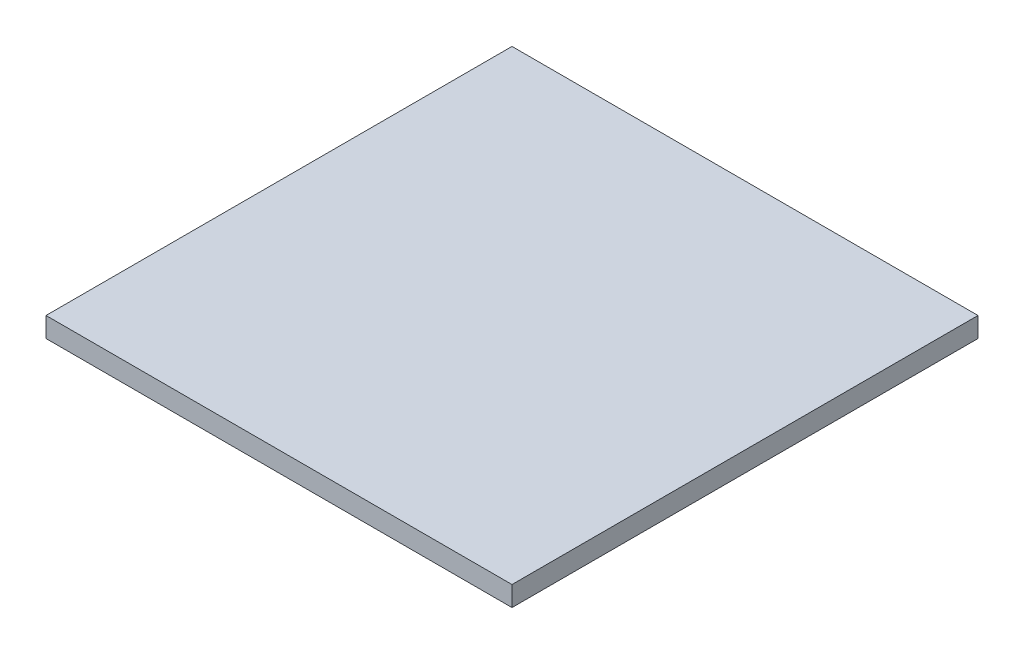
ISO-10303-21;
HEADER;
FILE_DESCRIPTION(('STEP AP214'),'2;1');
FILE_NAME('part.step','',(''),(''),'','','');
FILE_SCHEMA(('AUTOMOTIVE_DESIGN { 1 0 10303 214 1 1 1 1 }'));
ENDSEC;
DATA;
#1=APPLICATION_CONTEXT('core data for automotive mechanical design processes');
#2=APPLICATION_PROTOCOL_DEFINITION('international standard','automotive_design',2000,#1);
#3=PRODUCT_CONTEXT('',#1,'mechanical');
#4=PRODUCT('Part','Part','',(#3));
#5=PRODUCT_RELATED_PRODUCT_CATEGORY('part','',(#4));
#6=PRODUCT_DEFINITION_FORMATION('','',#4);
#7=PRODUCT_DEFINITION_CONTEXT('part definition',#1,'design');
#8=PRODUCT_DEFINITION('design','',#6,#7);
#9=PRODUCT_DEFINITION_SHAPE('','',#8);
#10=(LENGTH_UNIT() NAMED_UNIT(*) SI_UNIT(.MILLI.,.METRE.));
#11=(NAMED_UNIT(*) PLANE_ANGLE_UNIT() SI_UNIT($,.RADIAN.));
#12=(NAMED_UNIT(*) SI_UNIT($,.STERADIAN.) SOLID_ANGLE_UNIT());
#13=UNCERTAINTY_MEASURE_WITH_UNIT(LENGTH_MEASURE(1.E-05),#10,'distance_accuracy_value','');
#14=(GEOMETRIC_REPRESENTATION_CONTEXT(3) GLOBAL_UNCERTAINTY_ASSIGNED_CONTEXT((#13)) GLOBAL_UNIT_ASSIGNED_CONTEXT((#10,
#11,#12)) REPRESENTATION_CONTEXT('',''));
#15=CARTESIAN_POINT('',(0.,0.,0.));
#16=DIRECTION('',(0.,0.,1.));
#17=DIRECTION('',(1.,0.,0.));
#18=AXIS2_PLACEMENT_3D('',#15,#16,#17);
#19=CARTESIAN_POINT('',(-458.461538461538,15.,-38.8461538461538));
#20=DIRECTION('',(1.,0.,0.));
#21=DIRECTION('',(0.,0.,-1.));
#22=AXIS2_PLACEMENT_3D('',#19,#20,#21);
#23=PLANE('',#22);
#24=DIRECTION('',(0.,0.,1.));
#25=VECTOR('',#24,1.);
#26=CARTESIAN_POINT('',(-458.461538461538,0.,-38.8461538461538));
#27=LINE('',#26,#25);
#28=CARTESIAN_POINT('',(-458.461538461538,0.,-388.846153846154));
#29=VERTEX_POINT('',#28);
#30=CARTESIAN_POINT('',(-458.461538461538,0.,-38.8461538461538));
#31=VERTEX_POINT('',#30);
#32=EDGE_CURVE('E95',#29,#31,#27,.T.);
#33=ORIENTED_EDGE('',*,*,#32,.T.);
#34=DIRECTION('',(0.,-1.,0.));
#35=VECTOR('',#34,1.);
#36=CARTESIAN_POINT('',(-458.461538461538,15.,-38.8461538461538));
#37=LINE('',#36,#35);
#38=CARTESIAN_POINT('',(-458.461538461538,15.,-38.8461538461538));
#39=VERTEX_POINT('',#38);
#40=EDGE_CURVE('E11',#39,#31,#37,.T.);
#41=ORIENTED_EDGE('',*,*,#40,.F.);
#42=DIRECTION('',(0.,0.,1.));
#43=VECTOR('',#42,1.);
#44=CARTESIAN_POINT('',(-458.461538461538,15.,-38.8461538461538));
#45=LINE('',#44,#43);
#46=CARTESIAN_POINT('',(-458.461538461538,15.,-388.846153846154));
#47=VERTEX_POINT('',#46);
#48=EDGE_CURVE('E83',#47,#39,#45,.T.);
#49=ORIENTED_EDGE('',*,*,#48,.F.);
#50=DIRECTION('',(0.,-1.,0.));
#51=VECTOR('',#50,1.);
#52=CARTESIAN_POINT('',(-458.461538461538,15.,-388.846153846154));
#53=LINE('',#52,#51);
#54=EDGE_CURVE('E91',#47,#29,#53,.T.);
#55=ORIENTED_EDGE('',*,*,#54,.T.);
#56=EDGE_LOOP('',(#33,#41,#49,#55));
#57=FACE_BOUND('',#56,.T.);
#58=ADVANCED_FACE('F32',(#57),#23,.F.);
#59=CARTESIAN_POINT('',(-458.461538461538,15.,-38.8461538461538));
#60=DIRECTION('',(0.,0.,-1.));
#61=DIRECTION('',(-1.,0.,0.));
#62=AXIS2_PLACEMENT_3D('',#59,#60,#61);
#63=PLANE('',#62);
#64=DIRECTION('',(1.,0.,0.));
#65=VECTOR('',#64,1.);
#66=CARTESIAN_POINT('',(-458.461538461538,0.,-38.8461538461538));
#67=LINE('',#66,#65);
#68=CARTESIAN_POINT('',(-108.461538461538,0.,-38.8461538461538));
#69=VERTEX_POINT('',#68);
#70=EDGE_CURVE('E87',#31,#69,#67,.T.);
#71=ORIENTED_EDGE('',*,*,#70,.T.);
#72=DIRECTION('',(0.,-1.,0.));
#73=VECTOR('',#72,1.);
#74=CARTESIAN_POINT('',(-108.461538461538,15.,-38.8461538461538));
#75=LINE('',#74,#73);
#76=CARTESIAN_POINT('',(-108.461538461538,15.,-38.8461538461538));
#77=VERTEX_POINT('',#76);
#78=EDGE_CURVE('E40',#77,#69,#75,.T.);
#79=ORIENTED_EDGE('',*,*,#78,.F.);
#80=DIRECTION('',(1.,0.,0.));
#81=VECTOR('',#80,1.);
#82=CARTESIAN_POINT('',(-458.461538461538,15.,-38.8461538461538));
#83=LINE('',#82,#81);
#84=EDGE_CURVE('E78',#39,#77,#83,.T.);
#85=ORIENTED_EDGE('',*,*,#84,.F.);
#86=ORIENTED_EDGE('',*,*,#40,.T.);
#87=EDGE_LOOP('',(#71,#79,#85,#86));
#88=FACE_BOUND('',#87,.T.);
#89=ADVANCED_FACE('F86',(#88),#63,.F.);
#90=CARTESIAN_POINT('',(-108.461538461538,15.,-38.8461538461538));
#91=DIRECTION('',(-1.,0.,0.));
#92=DIRECTION('',(0.,0.,1.));
#93=AXIS2_PLACEMENT_3D('',#90,#91,#92);
#94=PLANE('',#93);
#95=DIRECTION('',(0.,0.,-1.));
#96=VECTOR('',#95,1.);
#97=CARTESIAN_POINT('',(-108.461538461538,0.,-38.8461538461538));
#98=LINE('',#97,#96);
#99=CARTESIAN_POINT('',(-108.461538461538,0.,-388.846153846154));
#100=VERTEX_POINT('',#99);
#101=EDGE_CURVE('E65',#69,#100,#98,.T.);
#102=ORIENTED_EDGE('',*,*,#101,.T.);
#103=DIRECTION('',(0.,-1.,0.));
#104=VECTOR('',#103,1.);
#105=CARTESIAN_POINT('',(-108.461538461538,15.,-388.846153846154));
#106=LINE('',#105,#104);
#107=CARTESIAN_POINT('',(-108.461538461538,15.,-388.846153846154));
#108=VERTEX_POINT('',#107);
#109=EDGE_CURVE('E88',#108,#100,#106,.T.);
#110=ORIENTED_EDGE('',*,*,#109,.F.);
#111=DIRECTION('',(0.,0.,-1.));
#112=VECTOR('',#111,1.);
#113=CARTESIAN_POINT('',(-108.461538461538,15.,-38.8461538461538));
#114=LINE('',#113,#112);
#115=EDGE_CURVE('E81',#77,#108,#114,.T.);
#116=ORIENTED_EDGE('',*,*,#115,.F.);
#117=ORIENTED_EDGE('',*,*,#78,.T.);
#118=EDGE_LOOP('',(#102,#110,#116,#117));
#119=FACE_BOUND('',#118,.T.);
#120=ADVANCED_FACE('F89',(#119),#94,.F.);
#121=CARTESIAN_POINT('',(-458.461538461538,15.,-388.846153846154));
#122=DIRECTION('',(0.,0.,1.));
#123=DIRECTION('',(1.,0.,0.));
#124=AXIS2_PLACEMENT_3D('',#121,#122,#123);
#125=PLANE('',#124);
#126=DIRECTION('',(-1.,0.,0.));
#127=VECTOR('',#126,1.);
#128=CARTESIAN_POINT('',(-458.461538461538,0.,-388.846153846154));
#129=LINE('',#128,#127);
#130=EDGE_CURVE('E71',#100,#29,#129,.T.);
#131=ORIENTED_EDGE('',*,*,#130,.T.);
#132=ORIENTED_EDGE('',*,*,#54,.F.);
#133=DIRECTION('',(-1.,0.,0.));
#134=VECTOR('',#133,1.);
#135=CARTESIAN_POINT('',(-458.461538461538,15.,-388.846153846154));
#136=LINE('',#135,#134);
#137=EDGE_CURVE('E48',#108,#47,#136,.T.);
#138=ORIENTED_EDGE('',*,*,#137,.F.);
#139=ORIENTED_EDGE('',*,*,#109,.T.);
#140=EDGE_LOOP('',(#131,#132,#138,#139));
#141=FACE_BOUND('',#140,.T.);
#142=ADVANCED_FACE('F102',(#141),#125,.F.);
#143=CARTESIAN_POINT('',(0.,15.,0.));
#144=DIRECTION('',(0.,-1.,0.));
#145=DIRECTION('',(0.,0.,-1.));
#146=AXIS2_PLACEMENT_3D('',#143,#144,#145);
#147=PLANE('',#146);
#148=ORIENTED_EDGE('',*,*,#48,.T.);
#149=ORIENTED_EDGE('',*,*,#84,.T.);
#150=ORIENTED_EDGE('',*,*,#115,.T.);
#151=ORIENTED_EDGE('',*,*,#137,.T.);
#152=EDGE_LOOP('',(#148,#149,#150,#151));
#153=FACE_BOUND('',#152,.T.);
#154=ADVANCED_FACE('F79',(#153),#147,.F.);
#155=CARTESIAN_POINT('',(0.,0.,0.));
#156=DIRECTION('',(0.,-1.,0.));
#157=DIRECTION('',(0.,0.,-1.));
#158=AXIS2_PLACEMENT_3D('',#155,#156,#157);
#159=PLANE('',#158);
#160=ORIENTED_EDGE('',*,*,#32,.F.);
#161=ORIENTED_EDGE('',*,*,#130,.F.);
#162=ORIENTED_EDGE('',*,*,#101,.F.);
#163=ORIENTED_EDGE('',*,*,#70,.F.);
#164=EDGE_LOOP('',(#160,#161,#162,#163));
#165=FACE_BOUND('',#164,.T.);
#166=ADVANCED_FACE('F105',(#165),#159,.T.);
#167=CLOSED_SHELL('',(#58,#89,#120,#142,#154,#166));
#168=MANIFOLD_SOLID_BREP('B2',#167);
#169=ADVANCED_BREP_SHAPE_REPRESENTATION('',(#18,#168),#14);
#170=SHAPE_DEFINITION_REPRESENTATION(#9,#169);
ENDSEC;
END-ISO-10303-21;
